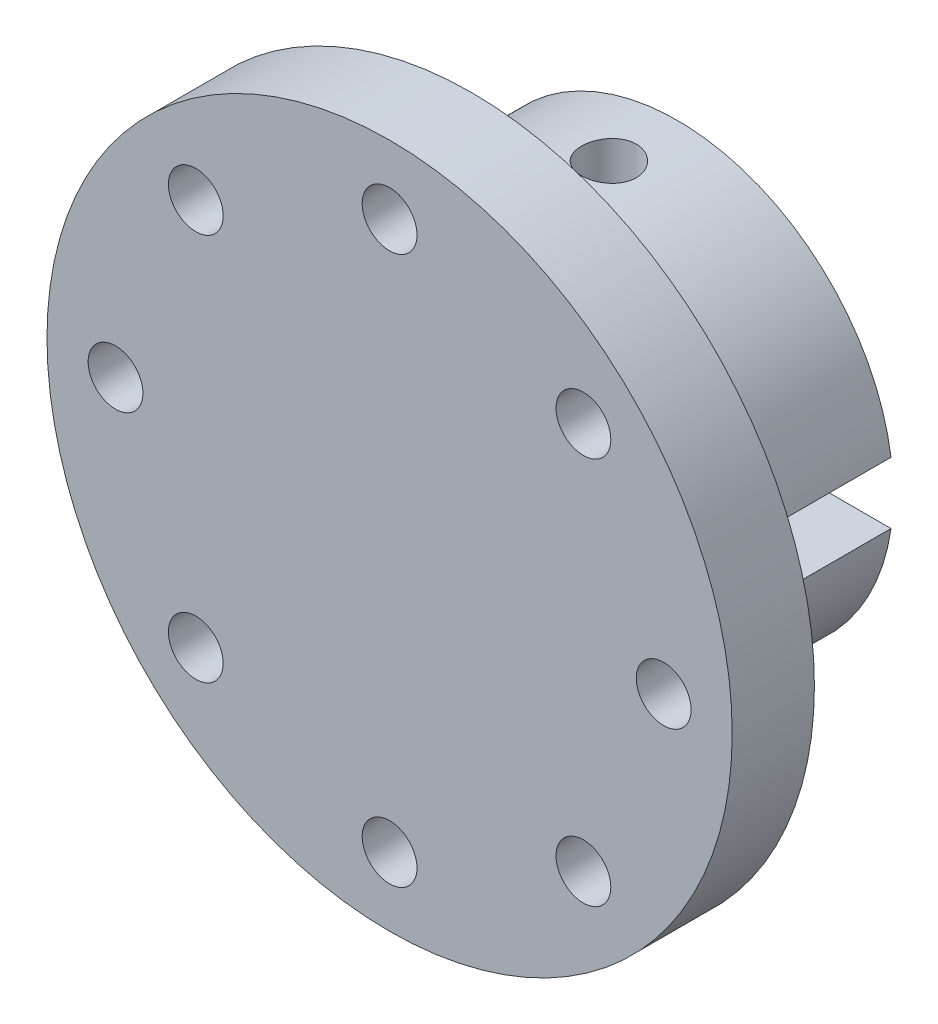
ISO-10303-21;
HEADER;
FILE_DESCRIPTION(('STEP AP214'),'2;1');
FILE_NAME('part.step','',(''),(''),'','','');
FILE_SCHEMA(('AUTOMOTIVE_DESIGN { 1 0 10303 214 1 1 1 1 }'));
ENDSEC;
DATA;
#1=APPLICATION_CONTEXT('core data for automotive mechanical design processes');
#2=APPLICATION_PROTOCOL_DEFINITION('international standard','automotive_design',2000,#1);
#3=PRODUCT_CONTEXT('',#1,'mechanical');
#4=PRODUCT('Part','Part','',(#3));
#5=PRODUCT_RELATED_PRODUCT_CATEGORY('part','',(#4));
#6=PRODUCT_DEFINITION_FORMATION('','',#4);
#7=PRODUCT_DEFINITION_CONTEXT('part definition',#1,'design');
#8=PRODUCT_DEFINITION('design','',#6,#7);
#9=PRODUCT_DEFINITION_SHAPE('','',#8);
#10=(LENGTH_UNIT() NAMED_UNIT(*) SI_UNIT(.MILLI.,.METRE.));
#11=(NAMED_UNIT(*) PLANE_ANGLE_UNIT() SI_UNIT($,.RADIAN.));
#12=(NAMED_UNIT(*) SI_UNIT($,.STERADIAN.) SOLID_ANGLE_UNIT());
#13=UNCERTAINTY_MEASURE_WITH_UNIT(LENGTH_MEASURE(1.E-05),#10,'distance_accuracy_value','');
#14=(GEOMETRIC_REPRESENTATION_CONTEXT(3) GLOBAL_UNCERTAINTY_ASSIGNED_CONTEXT((#13)) GLOBAL_UNIT_ASSIGNED_CONTEXT((#10,
#11,#12)) REPRESENTATION_CONTEXT('',''));
#15=CARTESIAN_POINT('',(0.,0.,0.));
#16=DIRECTION('',(0.,0.,1.));
#17=DIRECTION('',(1.,0.,0.));
#18=AXIS2_PLACEMENT_3D('',#15,#16,#17);
#19=CARTESIAN_POINT('',(0.,0.,30.));
#20=DIRECTION('',(0.,0.,-1.));
#21=DIRECTION('',(-1.,0.,0.));
#22=AXIS2_PLACEMENT_3D('',#19,#20,#21);
#23=CYLINDRICAL_SURFACE('',#22,31.5);
#24=CARTESIAN_POINT('',(0.,-31.5,14.));
#25=CARTESIAN_POINT('',(0.223715988029635,-31.4999968385272,13.9999905139822));
#26=CARTESIAN_POINT('',(0.447571046953037,-31.4975915656665,13.9811683976714));
#27=CARTESIAN_POINT('',(0.889050007646818,-31.4882278259735,13.9063815587767));
#28=CARTESIAN_POINT('',(1.10666718973841,-31.4812646283541,13.8503782440103));
#29=CARTESIAN_POINT('',(1.52921533330555,-31.4635693402177,13.70290735705));
#30=CARTESIAN_POINT('',(1.73415480156245,-31.452839809906,13.6114638713105));
#31=CARTESIAN_POINT('',(2.12574055461284,-31.4288046328235,13.3957615308791));
#32=CARTESIAN_POINT('',(2.31238992622698,-31.4154994218823,13.2715082266256));
#33=CARTESIAN_POINT('',(2.66319458837522,-31.3877135536644,12.9929598263881));
#34=CARTESIAN_POINT('',(2.82723114008826,-31.3732272833207,12.8385157351573));
#35=CARTESIAN_POINT('',(3.12713101980095,-31.3447571495527,12.5042898264536));
#36=CARTESIAN_POINT('',(3.26299289911508,-31.330773311993,12.3245067068962));
#37=CARTESIAN_POINT('',(3.50313059708383,-31.3048361557336,11.943932517998));
#38=CARTESIAN_POINT('',(3.60729489508018,-31.2928900697002,11.7430705450654));
#39=CARTESIAN_POINT('',(3.78036835194999,-31.2724552247304,11.3265274333147));
#40=CARTESIAN_POINT('',(3.84927888969153,-31.2639663305768,11.1108468744652));
#41=CARTESIAN_POINT('',(3.94952729224959,-31.2514607408546,10.6720226164006));
#42=CARTESIAN_POINT('',(3.98106586774557,-31.2474201634467,10.448925461574));
#43=CARTESIAN_POINT('',(4.00629620054563,-31.2441956526057,10.0005711350202));
#44=CARTESIAN_POINT('',(3.99998952690938,-31.2450115178251,9.77531405323));
#45=CARTESIAN_POINT('',(3.94987309056604,-31.2513858552307,9.33043426729749));
#46=CARTESIAN_POINT('',(3.90628459707474,-31.2569163452738,9.1107861788437));
#47=CARTESIAN_POINT('',(3.78318715505678,-31.2720531348819,8.68194759949074));
#48=CARTESIAN_POINT('',(3.70367745748401,-31.2816595194392,8.47275732676397));
#49=CARTESIAN_POINT('',(3.51075732888359,-31.3038973648617,8.07008616420944));
#50=CARTESIAN_POINT('',(3.39725092155177,-31.3165373696133,7.8766517478134));
#51=CARTESIAN_POINT('',(3.13962804024007,-31.3434116686128,7.51149250429581));
#52=CARTESIAN_POINT('',(2.99551012160296,-31.357646038089,7.33976870237947));
#53=CARTESIAN_POINT('',(2.67952976741088,-31.3862295409855,7.02162111791055));
#54=CARTESIAN_POINT('',(2.50747664413859,-31.4005787683682,6.87538666593873));
#55=CARTESIAN_POINT('',(2.14116591323289,-31.4276801792938,6.61384361199306));
#56=CARTESIAN_POINT('',(1.94690825156946,-31.4404323589506,6.49853508527313));
#57=CARTESIAN_POINT('',(1.54155537823475,-31.4629111251128,6.30211622838825));
#58=CARTESIAN_POINT('',(1.33045426216087,-31.4726366447289,6.2210179536712));
#59=CARTESIAN_POINT('',(0.897479561472159,-31.4879566727442,6.09547302518095));
#60=CARTESIAN_POINT('',(0.67560649796854,-31.4935513807666,6.05102460027625));
#61=CARTESIAN_POINT('',(0.22902288936679,-31.4999534285672,6.00028695056377));
#62=CARTESIAN_POINT('',(0.00434242215663778,-31.5007934836124,5.99373695167001));
#63=CARTESIAN_POINT('',(-0.44291305857792,-31.4976799565989,6.01829360691692));
#64=CARTESIAN_POINT('',(-0.665488118299926,-31.4937264799686,6.04939943285944));
#65=CARTESIAN_POINT('',(-1.10144374404205,-31.4814904877344,6.14816810378932));
#66=CARTESIAN_POINT('',(-1.31485297428713,-31.473222722907,6.21570641061619));
#67=CARTESIAN_POINT('',(-1.72731635019034,-31.4532836620352,6.38529326491254));
#68=CARTESIAN_POINT('',(-1.92636999397529,-31.4416122470706,6.48734301819785));
#69=CARTESIAN_POINT('',(-2.30563511866451,-31.4160852471459,6.7236854741392));
#70=CARTESIAN_POINT('',(-2.48574085824149,-31.4022183857714,6.85814662379575));
#71=CARTESIAN_POINT('',(-2.82092133636619,-31.373886434308,7.1552569848781));
#72=CARTESIAN_POINT('',(-2.97599504780794,-31.3594213197024,7.31790735238712));
#73=CARTESIAN_POINT('',(-3.25763645168321,-31.3314220283463,7.66792870737327));
#74=CARTESIAN_POINT('',(-3.38403113744102,-31.3178938267114,7.85543945089358));
#75=CARTESIAN_POINT('',(-3.60353087261144,-31.293398902391,8.24918160017111));
#76=CARTESIAN_POINT('',(-3.69663660728626,-31.2824321269796,8.4554126204567));
#77=CARTESIAN_POINT('',(-3.84663628723283,-31.2643426408956,8.88018605455309));
#78=CARTESIAN_POINT('',(-3.90362729921099,-31.2572096339925,9.0986937340964));
#79=CARTESIAN_POINT('',(-3.98009210669878,-31.2475659310234,9.54227413626226));
#80=CARTESIAN_POINT('',(-3.99956770798083,-31.2450550124773,9.76734654236785));
#81=CARTESIAN_POINT('',(-4.00041500529707,-31.244946400951,10.2159460136531));
#82=CARTESIAN_POINT('',(-3.98205851430745,-31.2473136596187,10.4394726055588));
#83=CARTESIAN_POINT('',(-3.90833879568296,-31.2566192596448,10.8802358056084));
#84=CARTESIAN_POINT('',(-3.85297556805972,-31.2635576010018,11.0974724137542));
#85=CARTESIAN_POINT('',(-3.70689975530108,-31.2812126450123,11.5194504165615));
#86=CARTESIAN_POINT('',(-3.61620070023479,-31.2919279013377,11.7241965591516));
#87=CARTESIAN_POINT('',(-3.40205458104028,-31.3159317720176,12.1156071867408));
#88=CARTESIAN_POINT('',(-3.27860705476147,-31.3292204226875,12.3022714165149));
#89=CARTESIAN_POINT('',(-3.00146122414132,-31.3569881289507,12.6536084028454));
#90=CARTESIAN_POINT('',(-2.84756041362567,-31.3714747534284,12.8181208296115));
#91=CARTESIAN_POINT('',(-2.51429978698192,-31.3999395620211,13.1190885476166));
#92=CARTESIAN_POINT('',(-2.33493398398538,-31.4139176255988,13.2555372224889));
#93=CARTESIAN_POINT('',(-1.95502619095531,-31.4398510921942,13.4969617670146));
#94=CARTESIAN_POINT('',(-1.75440391254395,-31.4517983479301,13.6018121106922));
#95=CARTESIAN_POINT('',(-1.33835826680321,-31.4722417520154,13.7761837064799));
#96=CARTESIAN_POINT('',(-1.12295121622904,-31.4807416355615,13.8457432165131));
#97=CARTESIAN_POINT('',(-0.755366800765214,-31.4912914915295,13.9309713312432));
#98=CARTESIAN_POINT('',(-0.605504101781293,-31.4945412100071,13.9568197094089));
#99=CARTESIAN_POINT('',(-0.303782303051817,-31.4988965294497,13.9913371985789));
#100=CARTESIAN_POINT('',(-0.151923218686825,-31.5000021469235,14.0000064418568));
#101=CARTESIAN_POINT('',(0.,-31.5,14.));
#102=B_SPLINE_CURVE_WITH_KNOTS('',3,(#24,#25,#26,#27,#28,#29,#30,#31,#32,#33,#34,#35,#36,#37,
#38,#39,#40,#41,#42,#43,#44,#45,#46,#47,#48,#49,#50,#51,#52,#53,#54,#55,#56,#57,#58,#59,#60,#61,
#62,#63,#64,#65,#66,#67,#68,#69,#70,#71,#72,#73,#74,#75,#76,#77,#78,#79,#80,#81,#82,#83,#84,#85,
#86,#87,#88,#89,#90,#91,#92,#93,#94,#95,#96,#97,#98,#99,#100,#101),.UNSPECIFIED.,.T.,.F.,(4,2,2,
2,2,2,2,2,2,2,2,2,2,2,2,2,2,2,2,2,2,2,2,2,2,2,2,2,2,2,2,2,2,2,2,2,2,2,4),(0.,0.670593021042293,
1.34188317380553,2.01271789068873,2.68343919505851,3.35755819670733,4.03171185162278,
4.70821064582307,5.38468297833752,6.05750552549396,6.73030017769764,7.39912925432749,
8.06797227834446,8.73872160559099,9.40950259472593,10.0850713656251,10.7606417804119,
11.4364500629031,12.1122256845373,12.7833458014479,13.4544511580829,14.123276860759,
14.7921259343465,15.46452905101,16.1369597504884,16.8133450010221,17.4897163271775,
18.1642619504989,18.8387751043285,19.5084589678988,20.1781428312585,20.8475705246481,
21.5170076655889,22.1910557893549,22.8652626463561,23.542113551401,24.2182291227463,
24.6736254291238,25.1290182290885),.UNSPECIFIED.);
#103=CARTESIAN_POINT('',(0.,-31.5,14.));
#104=VERTEX_POINT('',#103);
#105=EDGE_CURVE('E86',#104,#104,#102,.T.);
#106=ORIENTED_EDGE('',*,*,#105,.T.);
#107=EDGE_LOOP('',(#106));
#108=FACE_BOUND('',#107,.T.);
#109=CARTESIAN_POINT('',(0.,0.,0.));
#110=DIRECTION('',(0.,0.,1.));
#111=DIRECTION('',(1.,0.,0.));
#112=AXIS2_PLACEMENT_3D('',#109,#110,#111);
#113=CIRCLE('',#112,31.5);
#114=CARTESIAN_POINT('',(-31.1769145362398,-4.5,0.));
#115=VERTEX_POINT('',#114);
#116=CARTESIAN_POINT('',(31.1769145362398,-4.5,0.));
#117=VERTEX_POINT('',#116);
#118=EDGE_CURVE('E84',#115,#117,#113,.T.);
#119=ORIENTED_EDGE('',*,*,#118,.T.);
#120=DIRECTION('',(0.,0.,-1.));
#121=VECTOR('',#120,1.);
#122=CARTESIAN_POINT('',(31.1769145362398,-4.5,30.));
#123=LINE('',#122,#121);
#124=CARTESIAN_POINT('',(31.1769145362398,-4.5,30.));
#125=VERTEX_POINT('',#124);
#126=EDGE_CURVE('E12',#125,#117,#123,.T.);
#127=ORIENTED_EDGE('',*,*,#126,.F.);
#128=CARTESIAN_POINT('',(0.,0.,30.));
#129=DIRECTION('',(0.,0.,1.));
#130=DIRECTION('',(1.,0.,0.));
#131=AXIS2_PLACEMENT_3D('',#128,#129,#130);
#132=CIRCLE('',#131,31.5);
#133=CARTESIAN_POINT('',(-31.1769145362398,-4.5,30.));
#134=VERTEX_POINT('',#133);
#135=EDGE_CURVE('E74',#134,#125,#132,.T.);
#136=ORIENTED_EDGE('',*,*,#135,.F.);
#137=DIRECTION('',(0.,0.,-1.));
#138=VECTOR('',#137,1.);
#139=CARTESIAN_POINT('',(-31.1769145362398,-4.5,30.));
#140=LINE('',#139,#138);
#141=EDGE_CURVE('E54',#134,#115,#140,.T.);
#142=ORIENTED_EDGE('',*,*,#141,.T.);
#143=EDGE_LOOP('',(#119,#127,#136,#142));
#144=FACE_BOUND('',#143,.T.);
#145=ADVANCED_FACE('F44',(#108,#144),#23,.T.);
#146=CARTESIAN_POINT('',(-14.5,-4.5,30.));
#147=DIRECTION('',(0.,-1.,0.));
#148=DIRECTION('',(0.,0.,-1.));
#149=AXIS2_PLACEMENT_3D('',#146,#147,#148);
#150=PLANE('',#149);
#151=CARTESIAN_POINT('',(0.,-4.5,10.));
#152=DIRECTION('',(0.,-1.,0.));
#153=DIRECTION('',(0.,0.,-1.));
#154=AXIS2_PLACEMENT_3D('',#151,#152,#153);
#155=CIRCLE('',#154,4.);
#156=CARTESIAN_POINT('',(0.,-4.5,6.));
#157=VERTEX_POINT('',#156);
#158=EDGE_CURVE('E48',#157,#157,#155,.T.);
#159=ORIENTED_EDGE('',*,*,#158,.T.);
#160=EDGE_LOOP('',(#159));
#161=FACE_BOUND('',#160,.T.);
#162=DIRECTION('',(-1.,0.,0.));
#163=VECTOR('',#162,1.);
#164=CARTESIAN_POINT('',(-14.5,-4.5,0.));
#165=LINE('',#164,#163);
#166=EDGE_CURVE('E69',#117,#115,#165,.T.);
#167=ORIENTED_EDGE('',*,*,#166,.T.);
#168=ORIENTED_EDGE('',*,*,#141,.F.);
#169=DIRECTION('',(-1.,0.,0.));
#170=VECTOR('',#169,1.);
#171=CARTESIAN_POINT('',(14.5,-4.5,30.));
#172=LINE('',#171,#170);
#173=EDGE_CURVE('E60',#125,#134,#172,.T.);
#174=ORIENTED_EDGE('',*,*,#173,.F.);
#175=ORIENTED_EDGE('',*,*,#126,.T.);
#176=EDGE_LOOP('',(#167,#168,#174,#175));
#177=FACE_BOUND('',#176,.T.);
#178=ADVANCED_FACE('F78',(#161,#177),#150,.F.);
#179=CARTESIAN_POINT('',(0.,0.,0.));
#180=DIRECTION('',(0.,0.,1.));
#181=DIRECTION('',(1.,0.,0.));
#182=AXIS2_PLACEMENT_3D('',#179,#180,#181);
#183=PLANE('',#182);
#184=ORIENTED_EDGE('',*,*,#118,.F.);
#185=ORIENTED_EDGE('',*,*,#166,.F.);
#186=EDGE_LOOP('',(#184,#185));
#187=FACE_BOUND('',#186,.T.);
#188=ADVANCED_FACE('F104',(#187),#183,.F.);
#189=CARTESIAN_POINT('',(0.,-50.,10.));
#190=DIRECTION('',(0.,1.,0.));
#191=DIRECTION('',(0.,0.,1.));
#192=AXIS2_PLACEMENT_3D('',#189,#190,#191);
#193=CYLINDRICAL_SURFACE('',#192,4.);
#194=ORIENTED_EDGE('',*,*,#158,.F.);
#195=EDGE_LOOP('',(#194));
#196=FACE_BOUND('',#195,.T.);
#197=ORIENTED_EDGE('',*,*,#105,.F.);
#198=EDGE_LOOP('',(#197));
#199=FACE_BOUND('',#198,.T.);
#200=ADVANCED_FACE('F99',(#196,#199),#193,.F.);
#201=CARTESIAN_POINT('',(0.,0.,30.));
#202=DIRECTION('',(0.,0.,1.));
#203=DIRECTION('',(1.,0.,0.));
#204=AXIS2_PLACEMENT_3D('',#201,#202,#203);
#205=PLANE('',#204);
#206=CARTESIAN_POINT('',(0.,0.,30.));
#207=DIRECTION('',(0.,0.,1.));
#208=DIRECTION('',(1.,0.,0.));
#209=AXIS2_PLACEMENT_3D('',#206,#207,#208);
#210=CIRCLE('',#209,50.);
#211=CARTESIAN_POINT('',(50.,0.,30.));
#212=VERTEX_POINT('',#211);
#213=EDGE_CURVE('E97',#212,#212,#210,.T.);
#214=ORIENTED_EDGE('',*,*,#213,.F.);
#215=EDGE_LOOP('',(#214));
#216=FACE_BOUND('',#215,.T.);
#217=CARTESIAN_POINT('',(40.,0.,30.));
#218=DIRECTION('',(0.,0.,1.));
#219=DIRECTION('',(1.,0.,0.));
#220=AXIS2_PLACEMENT_3D('',#217,#218,#219);
#221=CIRCLE('',#220,4.);
#222=CARTESIAN_POINT('',(44.,0.,30.));
#223=VERTEX_POINT('',#222);
#224=EDGE_CURVE('E284',#223,#223,#221,.T.);
#225=ORIENTED_EDGE('',*,*,#224,.T.);
#226=EDGE_LOOP('',(#225));
#227=FACE_BOUND('',#226,.T.);
#228=CARTESIAN_POINT('',(-40.,0.,30.));
#229=DIRECTION('',(0.,0.,1.));
#230=DIRECTION('',(1.,0.,0.));
#231=AXIS2_PLACEMENT_3D('',#228,#229,#230);
#232=CIRCLE('',#231,4.);
#233=CARTESIAN_POINT('',(-36.,0.,30.));
#234=VERTEX_POINT('',#233);
#235=EDGE_CURVE('E278',#234,#234,#232,.T.);
#236=ORIENTED_EDGE('',*,*,#235,.T.);
#237=EDGE_LOOP('',(#236));
#238=FACE_BOUND('',#237,.T.);
#239=CARTESIAN_POINT('',(-28.2842712474618,28.284271247462,30.));
#240=DIRECTION('',(0.,0.,1.));
#241=DIRECTION('',(1.,0.,0.));
#242=AXIS2_PLACEMENT_3D('',#239,#240,#241);
#243=CIRCLE('',#242,3.99999999999993);
#244=CARTESIAN_POINT('',(-24.2842712474619,28.284271247462,30.));
#245=VERTEX_POINT('',#244);
#246=EDGE_CURVE('E272',#245,#245,#243,.T.);
#247=ORIENTED_EDGE('',*,*,#246,.T.);
#248=EDGE_LOOP('',(#247));
#249=FACE_BOUND('',#248,.T.);
#250=CARTESIAN_POINT('',(-28.2842712474618,-28.284271247462,30.));
#251=DIRECTION('',(0.,0.,1.));
#252=DIRECTION('',(1.,0.,0.));
#253=AXIS2_PLACEMENT_3D('',#250,#251,#252);
#254=CIRCLE('',#253,3.99999999999996);
#255=CARTESIAN_POINT('',(-24.2842712474618,-28.284271247462,30.));
#256=VERTEX_POINT('',#255);
#257=EDGE_CURVE('E266',#256,#256,#254,.T.);
#258=ORIENTED_EDGE('',*,*,#257,.T.);
#259=EDGE_LOOP('',(#258));
#260=FACE_BOUND('',#259,.T.);
#261=CARTESIAN_POINT('',(28.2842712474618,-28.284271247462,30.));
#262=DIRECTION('',(0.,0.,1.));
#263=DIRECTION('',(1.,0.,0.));
#264=AXIS2_PLACEMENT_3D('',#261,#262,#263);
#265=CIRCLE('',#264,4.00000000000008);
#266=CARTESIAN_POINT('',(32.2842712474619,-28.284271247462,30.));
#267=VERTEX_POINT('',#266);
#268=EDGE_CURVE('E260',#267,#267,#265,.T.);
#269=ORIENTED_EDGE('',*,*,#268,.T.);
#270=EDGE_LOOP('',(#269));
#271=FACE_BOUND('',#270,.T.);
#272=CARTESIAN_POINT('',(28.2842712474618,28.284271247462,30.));
#273=DIRECTION('',(0.,0.,1.));
#274=DIRECTION('',(1.,0.,0.));
#275=AXIS2_PLACEMENT_3D('',#272,#273,#274);
#276=CIRCLE('',#275,4.00000000000003);
#277=CARTESIAN_POINT('',(32.2842712474618,28.284271247462,30.));
#278=VERTEX_POINT('',#277);
#279=EDGE_CURVE('E254',#278,#278,#276,.T.);
#280=ORIENTED_EDGE('',*,*,#279,.T.);
#281=EDGE_LOOP('',(#280));
#282=FACE_BOUND('',#281,.T.);
#283=CARTESIAN_POINT('',(0.,40.,30.));
#284=DIRECTION('',(0.,0.,1.));
#285=DIRECTION('',(1.,0.,0.));
#286=AXIS2_PLACEMENT_3D('',#283,#284,#285);
#287=CIRCLE('',#286,4.);
#288=CARTESIAN_POINT('',(4.,40.,30.));
#289=VERTEX_POINT('',#288);
#290=EDGE_CURVE('E248',#289,#289,#287,.T.);
#291=ORIENTED_EDGE('',*,*,#290,.T.);
#292=EDGE_LOOP('',(#291));
#293=FACE_BOUND('',#292,.T.);
#294=CARTESIAN_POINT('',(0.,-40.,30.));
#295=DIRECTION('',(0.,0.,1.));
#296=DIRECTION('',(1.,0.,0.));
#297=AXIS2_PLACEMENT_3D('',#294,#295,#296);
#298=CIRCLE('',#297,4.);
#299=CARTESIAN_POINT('',(4.,-40.,30.));
#300=VERTEX_POINT('',#299);
#301=EDGE_CURVE('E245',#300,#300,#298,.T.);
#302=ORIENTED_EDGE('',*,*,#301,.T.);
#303=EDGE_LOOP('',(#302));
#304=FACE_BOUND('',#303,.T.);
#305=ORIENTED_EDGE('',*,*,#173,.T.);
#306=ORIENTED_EDGE('',*,*,#135,.T.);
#307=EDGE_LOOP('',(#305,#306));
#308=FACE_BOUND('',#307,.T.);
#309=ADVANCED_FACE('F80',(#216,#227,#238,#249,#260,#271,#282,#293,#304,#308),#205,.F.);
#310=CARTESIAN_POINT('',(0.,0.,42.));
#311=DIRECTION('',(0.,0.,1.));
#312=DIRECTION('',(1.,0.,0.));
#313=AXIS2_PLACEMENT_3D('',#310,#311,#312);
#314=PLANE('',#313);
#315=CARTESIAN_POINT('',(0.,40.,42.));
#316=DIRECTION('',(0.,0.,1.));
#317=DIRECTION('',(1.,0.,0.));
#318=AXIS2_PLACEMENT_3D('',#315,#316,#317);
#319=CIRCLE('',#318,4.);
#320=CARTESIAN_POINT('',(4.,40.,42.));
#321=VERTEX_POINT('',#320);
#322=EDGE_CURVE('E251',#321,#321,#319,.T.);
#323=ORIENTED_EDGE('',*,*,#322,.F.);
#324=EDGE_LOOP('',(#323));
#325=FACE_BOUND('',#324,.T.);
#326=CARTESIAN_POINT('',(28.2842712474618,-28.284271247462,42.));
#327=DIRECTION('',(0.,0.,1.));
#328=DIRECTION('',(1.,0.,0.));
#329=AXIS2_PLACEMENT_3D('',#326,#327,#328);
#330=CIRCLE('',#329,4.00000000000008);
#331=CARTESIAN_POINT('',(32.2842712474619,-28.284271247462,42.));
#332=VERTEX_POINT('',#331);
#333=EDGE_CURVE('E263',#332,#332,#330,.T.);
#334=ORIENTED_EDGE('',*,*,#333,.F.);
#335=EDGE_LOOP('',(#334));
#336=FACE_BOUND('',#335,.T.);
#337=CARTESIAN_POINT('',(-28.2842712474618,28.284271247462,42.));
#338=DIRECTION('',(0.,0.,1.));
#339=DIRECTION('',(1.,0.,0.));
#340=AXIS2_PLACEMENT_3D('',#337,#338,#339);
#341=CIRCLE('',#340,3.99999999999993);
#342=CARTESIAN_POINT('',(-24.2842712474619,28.284271247462,42.));
#343=VERTEX_POINT('',#342);
#344=EDGE_CURVE('E275',#343,#343,#341,.T.);
#345=ORIENTED_EDGE('',*,*,#344,.F.);
#346=EDGE_LOOP('',(#345));
#347=FACE_BOUND('',#346,.T.);
#348=CARTESIAN_POINT('',(40.,0.,42.));
#349=DIRECTION('',(0.,0.,1.));
#350=DIRECTION('',(1.,0.,0.));
#351=AXIS2_PLACEMENT_3D('',#348,#349,#350);
#352=CIRCLE('',#351,4.);
#353=CARTESIAN_POINT('',(44.,0.,42.));
#354=VERTEX_POINT('',#353);
#355=EDGE_CURVE('E287',#354,#354,#352,.T.);
#356=ORIENTED_EDGE('',*,*,#355,.F.);
#357=EDGE_LOOP('',(#356));
#358=FACE_BOUND('',#357,.T.);
#359=CARTESIAN_POINT('',(0.,0.,42.));
#360=DIRECTION('',(0.,0.,1.));
#361=DIRECTION('',(1.,0.,0.));
#362=AXIS2_PLACEMENT_3D('',#359,#360,#361);
#363=CIRCLE('',#362,50.);
#364=CARTESIAN_POINT('',(50.,0.,42.));
#365=VERTEX_POINT('',#364);
#366=EDGE_CURVE('E91',#365,#365,#363,.T.);
#367=ORIENTED_EDGE('',*,*,#366,.T.);
#368=EDGE_LOOP('',(#367));
#369=FACE_BOUND('',#368,.T.);
#370=CARTESIAN_POINT('',(-40.,0.,42.));
#371=DIRECTION('',(0.,0.,1.));
#372=DIRECTION('',(1.,0.,0.));
#373=AXIS2_PLACEMENT_3D('',#370,#371,#372);
#374=CIRCLE('',#373,4.);
#375=CARTESIAN_POINT('',(-36.,0.,42.));
#376=VERTEX_POINT('',#375);
#377=EDGE_CURVE('E281',#376,#376,#374,.T.);
#378=ORIENTED_EDGE('',*,*,#377,.F.);
#379=EDGE_LOOP('',(#378));
#380=FACE_BOUND('',#379,.T.);
#381=CARTESIAN_POINT('',(-28.2842712474618,-28.284271247462,42.));
#382=DIRECTION('',(0.,0.,1.));
#383=DIRECTION('',(1.,0.,0.));
#384=AXIS2_PLACEMENT_3D('',#381,#382,#383);
#385=CIRCLE('',#384,3.99999999999996);
#386=CARTESIAN_POINT('',(-24.2842712474618,-28.284271247462,42.));
#387=VERTEX_POINT('',#386);
#388=EDGE_CURVE('E269',#387,#387,#385,.T.);
#389=ORIENTED_EDGE('',*,*,#388,.F.);
#390=EDGE_LOOP('',(#389));
#391=FACE_BOUND('',#390,.T.);
#392=CARTESIAN_POINT('',(28.2842712474618,28.284271247462,42.));
#393=DIRECTION('',(0.,0.,1.));
#394=DIRECTION('',(1.,0.,0.));
#395=AXIS2_PLACEMENT_3D('',#392,#393,#394);
#396=CIRCLE('',#395,4.00000000000003);
#397=CARTESIAN_POINT('',(32.2842712474618,28.284271247462,42.));
#398=VERTEX_POINT('',#397);
#399=EDGE_CURVE('E257',#398,#398,#396,.T.);
#400=ORIENTED_EDGE('',*,*,#399,.F.);
#401=EDGE_LOOP('',(#400));
#402=FACE_BOUND('',#401,.T.);
#403=CARTESIAN_POINT('',(0.,-40.,42.));
#404=DIRECTION('',(0.,0.,1.));
#405=DIRECTION('',(1.,0.,0.));
#406=AXIS2_PLACEMENT_3D('',#403,#404,#405);
#407=CIRCLE('',#406,4.);
#408=CARTESIAN_POINT('',(4.,-40.,42.));
#409=VERTEX_POINT('',#408);
#410=EDGE_CURVE('E242',#409,#409,#407,.T.);
#411=ORIENTED_EDGE('',*,*,#410,.F.);
#412=EDGE_LOOP('',(#411));
#413=FACE_BOUND('',#412,.T.);
#414=ADVANCED_FACE('F138',(#325,#336,#347,#358,#369,#380,#391,#402,#413),#314,.T.);
#415=CARTESIAN_POINT('',(0.,0.,42.));
#416=DIRECTION('',(0.,0.,-1.));
#417=DIRECTION('',(-1.,0.,0.));
#418=AXIS2_PLACEMENT_3D('',#415,#416,#417);
#419=CYLINDRICAL_SURFACE('',#418,50.);
#420=ORIENTED_EDGE('',*,*,#366,.F.);
#421=EDGE_LOOP('',(#420));
#422=FACE_BOUND('',#421,.T.);
#423=ORIENTED_EDGE('',*,*,#213,.T.);
#424=EDGE_LOOP('',(#423));
#425=FACE_BOUND('',#424,.T.);
#426=ADVANCED_FACE('F106',(#422,#425),#419,.T.);
#427=CARTESIAN_POINT('',(40.,0.,42.));
#428=DIRECTION('',(0.,0.,-1.));
#429=DIRECTION('',(-1.,0.,0.));
#430=AXIS2_PLACEMENT_3D('',#427,#428,#429);
#431=CYLINDRICAL_SURFACE('',#430,4.);
#432=ORIENTED_EDGE('',*,*,#355,.T.);
#433=EDGE_LOOP('',(#432));
#434=FACE_BOUND('',#433,.T.);
#435=ORIENTED_EDGE('',*,*,#224,.F.);
#436=EDGE_LOOP('',(#435));
#437=FACE_BOUND('',#436,.T.);
#438=ADVANCED_FACE('F156',(#434,#437),#431,.F.);
#439=CARTESIAN_POINT('',(-40.,0.,42.));
#440=DIRECTION('',(0.,0.,-1.));
#441=DIRECTION('',(-1.,0.,0.));
#442=AXIS2_PLACEMENT_3D('',#439,#440,#441);
#443=CYLINDRICAL_SURFACE('',#442,4.);
#444=ORIENTED_EDGE('',*,*,#377,.T.);
#445=EDGE_LOOP('',(#444));
#446=FACE_BOUND('',#445,.T.);
#447=ORIENTED_EDGE('',*,*,#235,.F.);
#448=EDGE_LOOP('',(#447));
#449=FACE_BOUND('',#448,.T.);
#450=ADVANCED_FACE('F165',(#446,#449),#443,.F.);
#451=CARTESIAN_POINT('',(-28.2842712474618,28.284271247462,42.));
#452=DIRECTION('',(0.,0.,-1.));
#453=DIRECTION('',(-1.,0.,0.));
#454=AXIS2_PLACEMENT_3D('',#451,#452,#453);
#455=CYLINDRICAL_SURFACE('',#454,3.99999999999993);
#456=ORIENTED_EDGE('',*,*,#344,.T.);
#457=EDGE_LOOP('',(#456));
#458=FACE_BOUND('',#457,.T.);
#459=ORIENTED_EDGE('',*,*,#246,.F.);
#460=EDGE_LOOP('',(#459));
#461=FACE_BOUND('',#460,.T.);
#462=ADVANCED_FACE('F175',(#458,#461),#455,.F.);
#463=CARTESIAN_POINT('',(-28.2842712474618,-28.284271247462,42.));
#464=DIRECTION('',(0.,0.,-1.));
#465=DIRECTION('',(-1.,0.,0.));
#466=AXIS2_PLACEMENT_3D('',#463,#464,#465);
#467=CYLINDRICAL_SURFACE('',#466,3.99999999999996);
#468=ORIENTED_EDGE('',*,*,#388,.T.);
#469=EDGE_LOOP('',(#468));
#470=FACE_BOUND('',#469,.T.);
#471=ORIENTED_EDGE('',*,*,#257,.F.);
#472=EDGE_LOOP('',(#471));
#473=FACE_BOUND('',#472,.T.);
#474=ADVANCED_FACE('F185',(#470,#473),#467,.F.);
#475=CARTESIAN_POINT('',(28.2842712474618,-28.284271247462,42.));
#476=DIRECTION('',(0.,0.,-1.));
#477=DIRECTION('',(-1.,0.,0.));
#478=AXIS2_PLACEMENT_3D('',#475,#476,#477);
#479=CYLINDRICAL_SURFACE('',#478,4.00000000000008);
#480=ORIENTED_EDGE('',*,*,#333,.T.);
#481=EDGE_LOOP('',(#480));
#482=FACE_BOUND('',#481,.T.);
#483=ORIENTED_EDGE('',*,*,#268,.F.);
#484=EDGE_LOOP('',(#483));
#485=FACE_BOUND('',#484,.T.);
#486=ADVANCED_FACE('F195',(#482,#485),#479,.F.);
#487=CARTESIAN_POINT('',(28.2842712474618,28.284271247462,42.));
#488=DIRECTION('',(0.,0.,-1.));
#489=DIRECTION('',(-1.,0.,0.));
#490=AXIS2_PLACEMENT_3D('',#487,#488,#489);
#491=CYLINDRICAL_SURFACE('',#490,4.00000000000003);
#492=ORIENTED_EDGE('',*,*,#399,.T.);
#493=EDGE_LOOP('',(#492));
#494=FACE_BOUND('',#493,.T.);
#495=ORIENTED_EDGE('',*,*,#279,.F.);
#496=EDGE_LOOP('',(#495));
#497=FACE_BOUND('',#496,.T.);
#498=ADVANCED_FACE('F205',(#494,#497),#491,.F.);
#499=CARTESIAN_POINT('',(0.,40.,42.));
#500=DIRECTION('',(0.,0.,-1.));
#501=DIRECTION('',(-1.,0.,0.));
#502=AXIS2_PLACEMENT_3D('',#499,#500,#501);
#503=CYLINDRICAL_SURFACE('',#502,4.);
#504=ORIENTED_EDGE('',*,*,#322,.T.);
#505=EDGE_LOOP('',(#504));
#506=FACE_BOUND('',#505,.T.);
#507=ORIENTED_EDGE('',*,*,#290,.F.);
#508=EDGE_LOOP('',(#507));
#509=FACE_BOUND('',#508,.T.);
#510=ADVANCED_FACE('F215',(#506,#509),#503,.F.);
#511=CARTESIAN_POINT('',(0.,-40.,42.));
#512=DIRECTION('',(0.,0.,-1.));
#513=DIRECTION('',(-1.,0.,0.));
#514=AXIS2_PLACEMENT_3D('',#511,#512,#513);
#515=CYLINDRICAL_SURFACE('',#514,4.);
#516=ORIENTED_EDGE('',*,*,#410,.T.);
#517=EDGE_LOOP('',(#516));
#518=FACE_BOUND('',#517,.T.);
#519=ORIENTED_EDGE('',*,*,#301,.F.);
#520=EDGE_LOOP('',(#519));
#521=FACE_BOUND('',#520,.T.);
#522=ADVANCED_FACE('F225',(#518,#521),#515,.F.);
#523=CLOSED_SHELL('',(#145,#178,#188,#200,#309,#414,#426,#438,#450,#462,#474,#486,#498,#510,#522));
#524=MANIFOLD_SOLID_BREP('B2',#523);
#525=CARTESIAN_POINT('',(0.,0.,30.));
#526=DIRECTION('',(0.,0.,-1.));
#527=DIRECTION('',(-1.,0.,0.));
#528=AXIS2_PLACEMENT_3D('',#525,#526,#527);
#529=CYLINDRICAL_SURFACE('',#528,31.5);
#530=CARTESIAN_POINT('',(0.,31.5,14.));
#531=CARTESIAN_POINT('',(-0.223715988029635,31.4999968385272,13.9999905139822));
#532=CARTESIAN_POINT('',(-0.447571046953037,31.4975915656665,13.9811683976714));
#533=CARTESIAN_POINT('',(-0.889050007646819,31.4882278259735,13.9063815587767));
#534=CARTESIAN_POINT('',(-1.10666718973841,31.4812646283541,13.8503782440103));
#535=CARTESIAN_POINT('',(-1.52921533330555,31.4635693402177,13.70290735705));
#536=CARTESIAN_POINT('',(-1.73415480156245,31.452839809906,13.6114638713105));
#537=CARTESIAN_POINT('',(-2.12574055461284,31.4288046328235,13.3957615308791));
#538=CARTESIAN_POINT('',(-2.31238992622699,31.4154994218823,13.2715082266256));
#539=CARTESIAN_POINT('',(-2.66319458837522,31.3877135536644,12.9929598263881));
#540=CARTESIAN_POINT('',(-2.82723114008826,31.3732272833207,12.8385157351573));
#541=CARTESIAN_POINT('',(-3.12713101980096,31.3447571495527,12.5042898264536));
#542=CARTESIAN_POINT('',(-3.26299289911508,31.330773311993,12.3245067068962));
#543=CARTESIAN_POINT('',(-3.50313059708383,31.3048361557336,11.943932517998));
#544=CARTESIAN_POINT('',(-3.60729489508018,31.2928900697002,11.7430705450654));
#545=CARTESIAN_POINT('',(-3.78036835194999,31.2724552247304,11.3265274333147));
#546=CARTESIAN_POINT('',(-3.84927888969153,31.2639663305768,11.1108468744652));
#547=CARTESIAN_POINT('',(-3.94952729224959,31.2514607408546,10.6720226164006));
#548=CARTESIAN_POINT('',(-3.98106586774557,31.2474201634467,10.448925461574));
#549=CARTESIAN_POINT('',(-4.00629620054563,31.2441956526057,10.0005711350202));
#550=CARTESIAN_POINT('',(-3.99998952690938,31.2450115178251,9.77531405323));
#551=CARTESIAN_POINT('',(-3.94987309056604,31.2513858552307,9.33043426729749));
#552=CARTESIAN_POINT('',(-3.90628459707474,31.2569163452738,9.11078617884369));
#553=CARTESIAN_POINT('',(-3.78318715505678,31.2720531348819,8.68194759949073));
#554=CARTESIAN_POINT('',(-3.70367745748401,31.2816595194392,8.47275732676397));
#555=CARTESIAN_POINT('',(-3.51075732888359,31.3038973648617,8.07008616420944));
#556=CARTESIAN_POINT('',(-3.39725092155177,31.3165373696133,7.8766517478134));
#557=CARTESIAN_POINT('',(-3.13962804024007,31.3434116686128,7.51149250429581));
#558=CARTESIAN_POINT('',(-2.99551012160296,31.357646038089,7.33976870237947));
#559=CARTESIAN_POINT('',(-2.67952976741088,31.3862295409855,7.02162111791055));
#560=CARTESIAN_POINT('',(-2.50747664413859,31.4005787683682,6.87538666593873));
#561=CARTESIAN_POINT('',(-2.14116591323289,31.4276801792938,6.61384361199306));
#562=CARTESIAN_POINT('',(-1.94690825156946,31.4404323589506,6.49853508527313));
#563=CARTESIAN_POINT('',(-1.54155537823475,31.4629111251128,6.30211622838825));
#564=CARTESIAN_POINT('',(-1.33045426216087,31.4726366447289,6.2210179536712));
#565=CARTESIAN_POINT('',(-0.89747956147216,31.4879566727442,6.09547302518095));
#566=CARTESIAN_POINT('',(-0.675606497968541,31.4935513807666,6.05102460027625));
#567=CARTESIAN_POINT('',(-0.229022889366791,31.4999534285672,6.00028695056377));
#568=CARTESIAN_POINT('',(-0.00434242215663751,31.5007934836124,5.99373695167001));
#569=CARTESIAN_POINT('',(0.442913058577921,31.4976799565989,6.01829360691692));
#570=CARTESIAN_POINT('',(0.665488118299927,31.4937264799686,6.04939943285944));
#571=CARTESIAN_POINT('',(1.10144374404206,31.4814904877344,6.14816810378932));
#572=CARTESIAN_POINT('',(1.31485297428713,31.473222722907,6.21570641061619));
#573=CARTESIAN_POINT('',(1.72731635019034,31.4532836620352,6.38529326491254));
#574=CARTESIAN_POINT('',(1.92636999397529,31.4416122470706,6.48734301819785));
#575=CARTESIAN_POINT('',(2.30563511866451,31.4160852471459,6.7236854741392));
#576=CARTESIAN_POINT('',(2.48574085824149,31.4022183857714,6.85814662379575));
#577=CARTESIAN_POINT('',(2.82092133636619,31.373886434308,7.15525698487811));
#578=CARTESIAN_POINT('',(2.97599504780794,31.3594213197024,7.31790735238712));
#579=CARTESIAN_POINT('',(3.25763645168321,31.3314220283463,7.66792870737327));
#580=CARTESIAN_POINT('',(3.38403113744102,31.3178938267114,7.85543945089358));
#581=CARTESIAN_POINT('',(3.60353087261144,31.293398902391,8.24918160017112));
#582=CARTESIAN_POINT('',(3.69663660728626,31.2824321269796,8.45541262045671));
#583=CARTESIAN_POINT('',(3.84663628723283,31.2643426408956,8.88018605455309));
#584=CARTESIAN_POINT('',(3.90362729921099,31.2572096339925,9.0986937340964));
#585=CARTESIAN_POINT('',(3.98009210669878,31.2475659310234,9.54227413626226));
#586=CARTESIAN_POINT('',(3.99956770798083,31.2450550124773,9.76734654236785));
#587=CARTESIAN_POINT('',(4.00041500529707,31.244946400951,10.2159460136531));
#588=CARTESIAN_POINT('',(3.98205851430745,31.2473136596187,10.4394726055588));
#589=CARTESIAN_POINT('',(3.90833879568296,31.2566192596448,10.8802358056084));
#590=CARTESIAN_POINT('',(3.85297556805972,31.2635576010018,11.0974724137542));
#591=CARTESIAN_POINT('',(3.70689975530108,31.2812126450123,11.5194504165615));
#592=CARTESIAN_POINT('',(3.61620070023479,31.2919279013377,11.7241965591516));
#593=CARTESIAN_POINT('',(3.40205458104028,31.3159317720176,12.1156071867408));
#594=CARTESIAN_POINT('',(3.27860705476147,31.3292204226875,12.3022714165149));
#595=CARTESIAN_POINT('',(3.00146122414132,31.3569881289507,12.6536084028454));
#596=CARTESIAN_POINT('',(2.84756041362567,31.3714747534284,12.8181208296115));
#597=CARTESIAN_POINT('',(2.51429978698192,31.3999395620211,13.1190885476166));
#598=CARTESIAN_POINT('',(2.33493398398539,31.4139176255988,13.2555372224889));
#599=CARTESIAN_POINT('',(1.95502619095532,31.4398510921942,13.4969617670146));
#600=CARTESIAN_POINT('',(1.75440391254395,31.4517983479301,13.6018121106922));
#601=CARTESIAN_POINT('',(1.33835826680321,31.4722417520154,13.7761837064799));
#602=CARTESIAN_POINT('',(1.12295121622904,31.4807416355615,13.8457432165131));
#603=CARTESIAN_POINT('',(0.755366800765214,31.4912914915295,13.9309713312432));
#604=CARTESIAN_POINT('',(0.605504101781293,31.4945412100071,13.9568197094089));
#605=CARTESIAN_POINT('',(0.303782303051817,31.4988965294497,13.9913371985789));
#606=CARTESIAN_POINT('',(0.151923218686825,31.5000021469235,14.0000064418568));
#607=CARTESIAN_POINT('',(0.,31.5,14.));
#608=B_SPLINE_CURVE_WITH_KNOTS('',3,(#530,#531,#532,#533,#534,#535,#536,#537,#538,#539,#540,
#541,#542,#543,#544,#545,#546,#547,#548,#549,#550,#551,#552,#553,#554,#555,#556,#557,#558,#559,
#560,#561,#562,#563,#564,#565,#566,#567,#568,#569,#570,#571,#572,#573,#574,#575,#576,#577,#578,
#579,#580,#581,#582,#583,#584,#585,#586,#587,#588,#589,#590,#591,#592,#593,#594,#595,#596,#597,
#598,#599,#600,#601,#602,#603,#604,#605,#606,#607),.UNSPECIFIED.,.T.,.F.,(4,2,2,2,2,2,2,2,2,2,2,
2,2,2,2,2,2,2,2,2,2,2,2,2,2,2,2,2,2,2,2,2,2,2,2,2,2,2,4),(0.,0.670593021042294,1.34188317380553,
2.01271789068873,2.68343919505851,3.35755819670733,4.03171185162278,4.70821064582307,
5.38468297833753,6.05750552549397,6.73030017769764,7.39912925432749,8.06797227834446,
8.73872160559099,9.40950259472593,10.0850713656251,10.7606417804119,11.4364500629031,
12.1122256845373,12.7833458014479,13.4544511580829,14.123276860759,14.7921259343465,
15.46452905101,16.1369597504884,16.8133450010221,17.4897163271775,18.1642619504989,
18.8387751043285,19.5084589678988,20.1781428312585,20.8475705246481,21.5170076655889,
22.1910557893549,22.8652626463561,23.542113551401,24.2182291227463,24.6736254291238,
25.1290182290885),.UNSPECIFIED.);
#609=CARTESIAN_POINT('',(0.,31.5,14.));
#610=VERTEX_POINT('',#609);
#611=EDGE_CURVE('E386',#610,#610,#608,.T.);
#612=ORIENTED_EDGE('',*,*,#611,.T.);
#613=EDGE_LOOP('',(#612));
#614=FACE_BOUND('',#613,.T.);
#615=CARTESIAN_POINT('',(0.,0.,0.));
#616=DIRECTION('',(0.,0.,1.));
#617=DIRECTION('',(1.,0.,0.));
#618=AXIS2_PLACEMENT_3D('',#615,#616,#617);
#619=CIRCLE('',#618,31.5);
#620=CARTESIAN_POINT('',(31.1769145362398,4.5,0.));
#621=VERTEX_POINT('',#620);
#622=CARTESIAN_POINT('',(-31.1769145362398,4.5,0.));
#623=VERTEX_POINT('',#622);
#624=EDGE_CURVE('E381',#621,#623,#619,.T.);
#625=ORIENTED_EDGE('',*,*,#624,.T.);
#626=DIRECTION('',(0.,0.,-1.));
#627=VECTOR('',#626,1.);
#628=CARTESIAN_POINT('',(-31.1769145362398,4.5,30.));
#629=LINE('',#628,#627);
#630=CARTESIAN_POINT('',(-31.1769145362398,4.5,30.));
#631=VERTEX_POINT('',#630);
#632=EDGE_CURVE('E42',#631,#623,#629,.T.);
#633=ORIENTED_EDGE('',*,*,#632,.F.);
#634=CARTESIAN_POINT('',(0.,0.,30.));
#635=DIRECTION('',(0.,0.,1.));
#636=DIRECTION('',(1.,0.,0.));
#637=AXIS2_PLACEMENT_3D('',#634,#635,#636);
#638=CIRCLE('',#637,31.5);
#639=CARTESIAN_POINT('',(31.1769145362398,4.5,30.));
#640=VERTEX_POINT('',#639);
#641=EDGE_CURVE('E380',#640,#631,#638,.T.);
#642=ORIENTED_EDGE('',*,*,#641,.F.);
#643=DIRECTION('',(0.,0.,-1.));
#644=VECTOR('',#643,1.);
#645=CARTESIAN_POINT('',(31.1769145362398,4.5,30.));
#646=LINE('',#645,#644);
#647=EDGE_CURVE('E358',#640,#621,#646,.T.);
#648=ORIENTED_EDGE('',*,*,#647,.T.);
#649=EDGE_LOOP('',(#625,#633,#642,#648));
#650=FACE_BOUND('',#649,.T.);
#651=ADVANCED_FACE('F348',(#614,#650),#529,.T.);
#652=CARTESIAN_POINT('',(14.5,4.5,30.));
#653=DIRECTION('',(0.,1.,0.));
#654=DIRECTION('',(0.,0.,1.));
#655=AXIS2_PLACEMENT_3D('',#652,#653,#654);
#656=PLANE('',#655);
#657=CARTESIAN_POINT('',(0.,4.5,10.));
#658=DIRECTION('',(0.,1.,0.));
#659=DIRECTION('',(0.,0.,1.));
#660=AXIS2_PLACEMENT_3D('',#657,#658,#659);
#661=CIRCLE('',#660,4.);
#662=CARTESIAN_POINT('',(0.,4.5,14.));
#663=VERTEX_POINT('',#662);
#664=EDGE_CURVE('E352',#663,#663,#661,.T.);
#665=ORIENTED_EDGE('',*,*,#664,.T.);
#666=EDGE_LOOP('',(#665));
#667=FACE_BOUND('',#666,.T.);
#668=DIRECTION('',(1.,0.,0.));
#669=VECTOR('',#668,1.);
#670=CARTESIAN_POINT('',(14.5,4.5,0.));
#671=LINE('',#670,#669);
#672=EDGE_CURVE('E373',#623,#621,#671,.T.);
#673=ORIENTED_EDGE('',*,*,#672,.T.);
#674=ORIENTED_EDGE('',*,*,#647,.F.);
#675=DIRECTION('',(1.,0.,0.));
#676=VECTOR('',#675,1.);
#677=CARTESIAN_POINT('',(-14.5,4.5,30.));
#678=LINE('',#677,#676);
#679=EDGE_CURVE('E365',#631,#640,#678,.T.);
#680=ORIENTED_EDGE('',*,*,#679,.F.);
#681=ORIENTED_EDGE('',*,*,#632,.T.);
#682=EDGE_LOOP('',(#673,#674,#680,#681));
#683=FACE_BOUND('',#682,.T.);
#684=ADVANCED_FACE('F376',(#667,#683),#656,.F.);
#685=CARTESIAN_POINT('',(0.,0.,30.));
#686=DIRECTION('',(0.,0.,1.));
#687=DIRECTION('',(1.,0.,0.));
#688=AXIS2_PLACEMENT_3D('',#685,#686,#687);
#689=PLANE('',#688);
#690=ORIENTED_EDGE('',*,*,#641,.T.);
#691=ORIENTED_EDGE('',*,*,#679,.T.);
#692=EDGE_LOOP('',(#690,#691));
#693=FACE_BOUND('',#692,.T.);
#694=ADVANCED_FACE('F401',(#693),#689,.T.);
#695=CARTESIAN_POINT('',(0.,0.,0.));
#696=DIRECTION('',(0.,0.,1.));
#697=DIRECTION('',(1.,0.,0.));
#698=AXIS2_PLACEMENT_3D('',#695,#696,#697);
#699=PLANE('',#698);
#700=ORIENTED_EDGE('',*,*,#624,.F.);
#701=ORIENTED_EDGE('',*,*,#672,.F.);
#702=EDGE_LOOP('',(#700,#701));
#703=FACE_BOUND('',#702,.T.);
#704=ADVANCED_FACE('F385',(#703),#699,.F.);
#705=CARTESIAN_POINT('',(0.,-50.,10.));
#706=DIRECTION('',(0.,1.,0.));
#707=DIRECTION('',(0.,0.,1.));
#708=AXIS2_PLACEMENT_3D('',#705,#706,#707);
#709=CYLINDRICAL_SURFACE('',#708,4.);
#710=ORIENTED_EDGE('',*,*,#664,.F.);
#711=EDGE_LOOP('',(#710));
#712=FACE_BOUND('',#711,.T.);
#713=ORIENTED_EDGE('',*,*,#611,.F.);
#714=EDGE_LOOP('',(#713));
#715=FACE_BOUND('',#714,.T.);
#716=ADVANCED_FACE('F396',(#712,#715),#709,.F.);
#717=CLOSED_SHELL('',(#651,#684,#694,#704,#716));
#718=MANIFOLD_SOLID_BREP('B6',#717);
#719=ADVANCED_BREP_SHAPE_REPRESENTATION('',(#18,#524,#718),#14);
#720=SHAPE_DEFINITION_REPRESENTATION(#9,#719);
ENDSEC;
END-ISO-10303-21;
